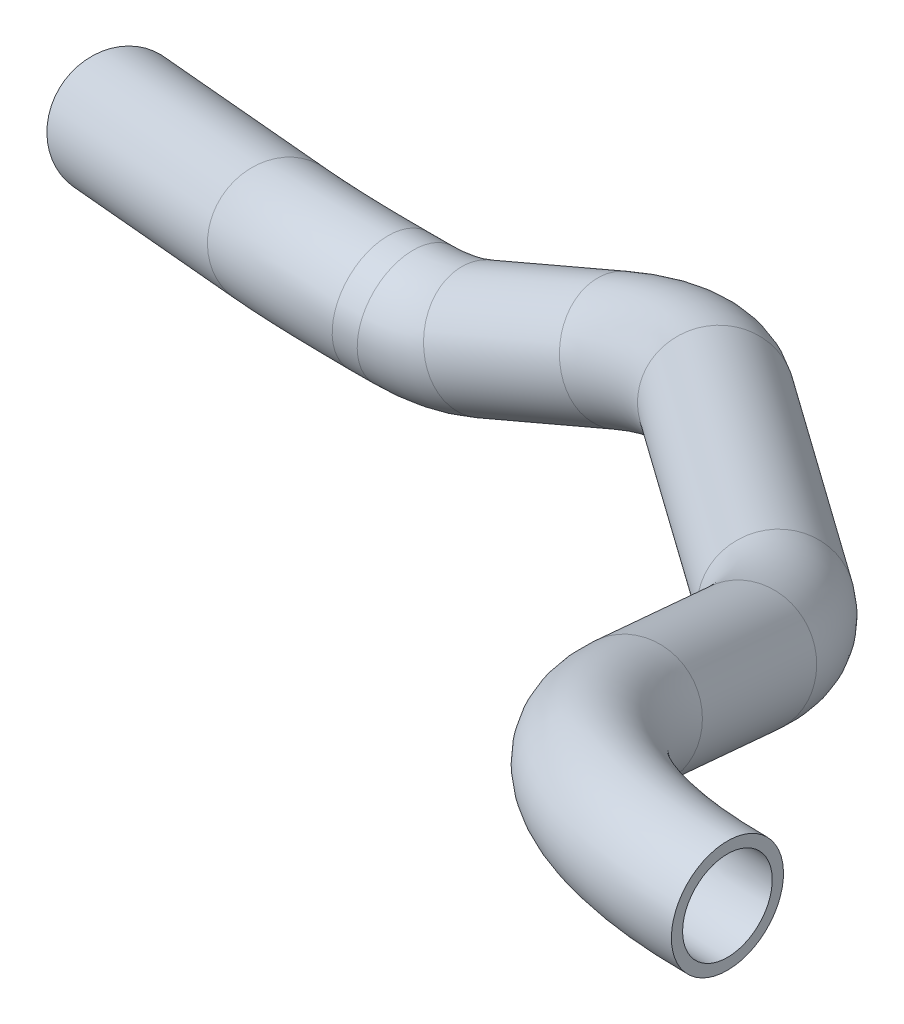
ISO-10303-21;
HEADER;
FILE_DESCRIPTION(('STEP AP214'),'2;1');
FILE_NAME('part.step','',(''),(''),'','','');
FILE_SCHEMA(('AUTOMOTIVE_DESIGN { 1 0 10303 214 1 1 1 1 }'));
ENDSEC;
DATA;
#1=APPLICATION_CONTEXT('core data for automotive mechanical design processes');
#2=APPLICATION_PROTOCOL_DEFINITION('international standard','automotive_design',2000,#1);
#3=PRODUCT_CONTEXT('',#1,'mechanical');
#4=PRODUCT('Part','Part','',(#3));
#5=PRODUCT_RELATED_PRODUCT_CATEGORY('part','',(#4));
#6=PRODUCT_DEFINITION_FORMATION('','',#4);
#7=PRODUCT_DEFINITION_CONTEXT('part definition',#1,'design');
#8=PRODUCT_DEFINITION('design','',#6,#7);
#9=PRODUCT_DEFINITION_SHAPE('','',#8);
#10=(LENGTH_UNIT() NAMED_UNIT(*) SI_UNIT(.MILLI.,.METRE.));
#11=(NAMED_UNIT(*) PLANE_ANGLE_UNIT() SI_UNIT($,.RADIAN.));
#12=(NAMED_UNIT(*) SI_UNIT($,.STERADIAN.) SOLID_ANGLE_UNIT());
#13=UNCERTAINTY_MEASURE_WITH_UNIT(LENGTH_MEASURE(1.E-05),#10,'distance_accuracy_value','');
#14=(GEOMETRIC_REPRESENTATION_CONTEXT(3) GLOBAL_UNCERTAINTY_ASSIGNED_CONTEXT((#13)) GLOBAL_UNIT_ASSIGNED_CONTEXT((#10,
#11,#12)) REPRESENTATION_CONTEXT('',''));
#15=CARTESIAN_POINT('',(0.,0.,0.));
#16=DIRECTION('',(0.,0.,1.));
#17=DIRECTION('',(1.,0.,0.));
#18=AXIS2_PLACEMENT_3D('',#15,#16,#17);
#19=CARTESIAN_POINT('',(1469.87575226089,-192.528815146171,370.16625089659));
#20=DIRECTION('',(-1.,0.,0.));
#21=DIRECTION('',(0.,0.,1.));
#22=AXIS2_PLACEMENT_3D('',#19,#20,#21);
#23=PLANE('',#22);
#24=CARTESIAN_POINT('',(1469.87575226089,-192.528815146171,370.16625089659));
#25=DIRECTION('',(-1.,0.,0.));
#26=DIRECTION('',(0.,0.,1.));
#27=AXIS2_PLACEMENT_3D('',#24,#25,#26);
#28=CIRCLE('',#27,10.);
#29=CARTESIAN_POINT('',(1469.87575226089,-188.752752163523,379.4259133284));
#30=VERTEX_POINT('',#29);
#31=EDGE_CURVE('E88',#30,#30,#28,.T.);
#32=ORIENTED_EDGE('',*,*,#31,.T.);
#33=EDGE_LOOP('',(#32));
#34=FACE_BOUND('',#33,.T.);
#35=CARTESIAN_POINT('',(1469.87575226089,-192.528815146171,370.16625089659));
#36=DIRECTION('',(-1.,0.,0.));
#37=DIRECTION('',(0.,0.,1.));
#38=AXIS2_PLACEMENT_3D('',#35,#36,#37);
#39=CIRCLE('',#38,12.5);
#40=CARTESIAN_POINT('',(1469.87575226089,-187.808736417861,381.740828936352));
#41=VERTEX_POINT('',#40);
#42=EDGE_CURVE('E81',#41,#41,#39,.T.);
#43=ORIENTED_EDGE('',*,*,#42,.F.);
#44=EDGE_LOOP('',(#43));
#45=FACE_BOUND('',#44,.T.);
#46=ADVANCED_FACE('F44',(#34,#45),#23,.F.);
#47=CARTESIAN_POINT('',(1129.69636479831,-313.45862452759,165.695334051761));
#48=DIRECTION('',(-0.909150416365021,-0.26394652904013,-0.32214554200078));
#49=DIRECTION('',(-0.358552645054609,0.102570695912625,0.92785734521226));
#50=AXIS2_PLACEMENT_3D('',#47,#48,#49);
#51=PLANE('',#50);
#52=CARTESIAN_POINT('',(1129.69636479831,-313.45862452759,165.695334051761));
#53=DIRECTION('',(-0.909150416365021,-0.26394652904013,-0.32214554200078));
#54=DIRECTION('',(-0.333989714420841,0.,0.9425767187137));
#55=AXIS2_PLACEMENT_3D('',#52,#53,#54);
#56=CIRCLE('',#55,10.);
#57=CARTESIAN_POINT('',(1126.35646765411,-313.45862452759,175.121101238898));
#58=VERTEX_POINT('',#57);
#59=EDGE_CURVE('E84',#58,#58,#56,.T.);
#60=ORIENTED_EDGE('',*,*,#59,.F.);
#61=EDGE_LOOP('',(#60));
#62=FACE_BOUND('',#61,.T.);
#63=CARTESIAN_POINT('',(1129.69636479831,-313.45862452759,165.695334051761));
#64=DIRECTION('',(-0.909150416365021,-0.26394652904013,-0.32214554200078));
#65=DIRECTION('',(-0.358552645054609,0.102570695912625,0.92785734521226));
#66=AXIS2_PLACEMENT_3D('',#63,#64,#65);
#67=CIRCLE('',#66,12.5);
#68=CARTESIAN_POINT('',(1125.21445673513,-312.176490828682,177.293550866915));
#69=VERTEX_POINT('',#68);
#70=EDGE_CURVE('E11',#69,#69,#67,.T.);
#71=ORIENTED_EDGE('',*,*,#70,.T.);
#72=EDGE_LOOP('',(#71));
#73=FACE_BOUND('',#72,.T.);
#74=ADVANCED_FACE('F146',(#62,#73),#51,.T.);
#75=CARTESIAN_POINT('',(1469.87575226089,-218.961256024707,305.348613873919));
#76=DIRECTION('',(0.,-0.925966243181015,0.37760629826479));
#77=DIRECTION('',(0.,-0.37760629826479,-0.925966243181015));
#78=AXIS2_PLACEMENT_3D('',#75,#76,#77);
#79=TOROIDAL_SURFACE('',#78,70.,12.5);
#80=CARTESIAN_POINT('',(1403.27637901142,-210.822780415799,325.305785455618));
#81=DIRECTION('',(-0.307897240603188,-0.359262039992662,-0.880982449228845));
#82=DIRECTION('',(-0.880982449228845,-0.241994204194298,0.406581762118168));
#83=AXIS2_PLACEMENT_3D('',#80,#81,#82);
#84=CIRCLE('',#83,12.5);
#85=CARTESIAN_POINT('',(1391.38363378831,-209.369481199922,328.869566095207));
#86=VERTEX_POINT('',#85);
#87=EDGE_CURVE('E78',#86,#86,#84,.T.);
#88=CARTESIAN_POINT('',(1469.87575226089,-218.961256024707,305.348613873919));
#89=DIRECTION('',(0.,-0.925966243181015,0.37760629826479));
#90=DIRECTION('',(0.,-0.37760629826479,-0.925966243181015));
#91=AXIS2_PLACEMENT_3D('',#88,#89,#90);
#92=CIRCLE('',#91,82.5);
#93=EDGE_CURVE('',#41,#86,#92,.T.);
#94=ORIENTED_EDGE('',*,*,#42,.T.);
#95=ORIENTED_EDGE('',*,*,#87,.F.);
#96=ORIENTED_EDGE('',*,*,#93,.T.);
#97=ORIENTED_EDGE('',*,*,#93,.F.);
#98=EDGE_LOOP('',(#94,#96,#95,#97));
#99=FACE_BOUND('',#98,.T.);
#100=ADVANCED_FACE('F148',(#99),#79,.T.);
#101=CARTESIAN_POINT('',(1403.27637901142,-210.822780415799,325.305785455618));
#102=DIRECTION('',(-0.30789724060319,-0.35926203999266,-0.880982449228845));
#103=DIRECTION('',(0.,0.925966243181016,-0.377606298264788));
#104=AXIS2_PLACEMENT_3D('',#101,#102,#103);
#105=CYLINDRICAL_SURFACE('',#104,12.5);
#106=CARTESIAN_POINT('',(1389.58101161959,-226.802870454931,286.11940533636));
#107=DIRECTION('',(-0.307897240603189,-0.35926203999266,-0.880982449228845));
#108=DIRECTION('',(-0.880982449228845,-0.241994204194297,0.406581762118169));
#109=AXIS2_PLACEMENT_3D('',#106,#107,#108);
#110=CIRCLE('',#109,12.5);
#111=CARTESIAN_POINT('',(1401.46216860999,-227.743917116426,282.350779625272));
#112=VERTEX_POINT('',#111);
#113=EDGE_CURVE('E75',#112,#112,#110,.T.);
#114=ORIENTED_EDGE('',*,*,#113,.F.);
#115=EDGE_LOOP('',(#114));
#116=FACE_BOUND('',#115,.T.);
#117=ORIENTED_EDGE('',*,*,#87,.T.);
#118=EDGE_LOOP('',(#117));
#119=FACE_BOUND('',#118,.T.);
#120=ADVANCED_FACE('F154',(#116,#119),#105,.T.);
#121=CARTESIAN_POINT('',(1332.55145806565,-222.285846479756,304.208808749585));
#122=DIRECTION('',(-0.0419902854601695,0.930195219391072,-0.364655549455879));
#123=DIRECTION('',(0.,0.36497745262786,0.931016358112616));
#124=AXIS2_PLACEMENT_3D('',#121,#122,#123);
#125=TOROIDAL_SURFACE('',#124,60.,12.5);
#126=CARTESIAN_POINT('',(1372.47298898949,-237.060176470793,261.924171562859));
#127=DIRECTION('',(-0.745341813091706,-0.272219196336702,-0.608573981372001));
#128=DIRECTION('',(-0.612463652726551,-0.0810007611596069,0.786337809583397));
#129=AXIS2_PLACEMENT_3D('',#126,#127,#128);
#130=CIRCLE('',#129,12.5);
#131=CARTESIAN_POINT('',(1380.78997459862,-240.138161885592,253.114872148958));
#132=VERTEX_POINT('',#131);
#133=EDGE_CURVE('E72',#132,#132,#130,.T.);
#134=CARTESIAN_POINT('',(1332.55145806565,-222.285846479756,304.208808749585));
#135=DIRECTION('',(-0.0419902854601695,0.930195219391072,-0.364655549455879));
#136=DIRECTION('',(0.,0.36497745262786,0.931016358112616));
#137=AXIS2_PLACEMENT_3D('',#134,#135,#136);
#138=CIRCLE('',#137,72.5);
#139=EDGE_CURVE('',#112,#132,#138,.T.);
#140=ORIENTED_EDGE('',*,*,#113,.T.);
#141=ORIENTED_EDGE('',*,*,#133,.F.);
#142=ORIENTED_EDGE('',*,*,#139,.T.);
#143=ORIENTED_EDGE('',*,*,#139,.F.);
#144=EDGE_LOOP('',(#140,#142,#141,#143));
#145=FACE_BOUND('',#144,.T.);
#146=ADVANCED_FACE('F176',(#145),#125,.T.);
#147=CARTESIAN_POINT('',(1372.47298898949,-237.060176470793,261.924171562859));
#148=DIRECTION('',(-0.745341813091704,-0.272219196336703,-0.608573981372003));
#149=DIRECTION('',(-0.632458611957457,0.,0.774594154484041));
#150=AXIS2_PLACEMENT_3D('',#147,#148,#149);
#151=CYLINDRICAL_SURFACE('',#150,12.5);
#152=CARTESIAN_POINT('',(1299.93258452587,-263.553914321236,202.694698615891));
#153=DIRECTION('',(-0.745341813091703,-0.272219196336703,-0.608573981372004));
#154=DIRECTION('',(-0.612463652726555,-0.0810007611596083,0.786337809583394));
#155=AXIS2_PLACEMENT_3D('',#152,#153,#154);
#156=CIRCLE('',#155,12.5);
#157=CARTESIAN_POINT('',(1306.67129295279,-259.917043552838,192.814770491105));
#158=VERTEX_POINT('',#157);
#159=EDGE_CURVE('E69',#158,#158,#156,.T.);
#160=ORIENTED_EDGE('',*,*,#159,.F.);
#161=EDGE_LOOP('',(#160));
#162=FACE_BOUND('',#161,.T.);
#163=ORIENTED_EDGE('',*,*,#133,.T.);
#164=EDGE_LOOP('',(#163));
#165=FACE_BOUND('',#164,.T.);
#166=ADVANCED_FACE('F180',(#162,#165),#151,.T.);
#167=CARTESIAN_POINT('',(1267.58678407666,-281.010894009548,250.118353614864));
#168=DIRECTION('',(-0.392224881380258,0.917194092673523,0.0701044848139922));
#169=DIRECTION('',(-0.919456273280743,-0.39319227042846,0.));
#170=AXIS2_PLACEMENT_3D('',#167,#168,#169);
#171=TOROIDAL_SURFACE('',#170,60.,12.5);
#172=CARTESIAN_POINT('',(1265.93291158359,-277.143413508709,190.265974377675));
#173=DIRECTION('',(-0.919456273280742,-0.393192270428462,0.));
#174=DIRECTION('',(-0.0598209863867292,0.139887747913272,0.988358673544919));
#175=AXIS2_PLACEMENT_3D('',#172,#173,#174);
#176=CIRCLE('',#175,12.5);
#177=CARTESIAN_POINT('',(1265.58835481419,-276.337688404367,177.796728703261));
#178=VERTEX_POINT('',#177);
#179=EDGE_CURVE('E66',#178,#178,#176,.T.);
#180=CARTESIAN_POINT('',(1267.58678407666,-281.010894009548,250.118353614864));
#181=DIRECTION('',(-0.392224881380258,0.917194092673523,0.0701044848139922));
#182=DIRECTION('',(-0.919456273280743,-0.39319227042846,0.));
#183=AXIS2_PLACEMENT_3D('',#180,#181,#182);
#184=CIRCLE('',#183,72.5);
#185=EDGE_CURVE('',#158,#178,#184,.T.);
#186=ORIENTED_EDGE('',*,*,#159,.T.);
#187=ORIENTED_EDGE('',*,*,#179,.F.);
#188=ORIENTED_EDGE('',*,*,#185,.T.);
#189=ORIENTED_EDGE('',*,*,#185,.F.);
#190=EDGE_LOOP('',(#186,#188,#187,#189));
#191=FACE_BOUND('',#190,.T.);
#192=ADVANCED_FACE('F184',(#191),#171,.T.);
#193=CARTESIAN_POINT('',(1265.93291158359,-277.143413508708,190.265974377675));
#194=DIRECTION('',(-0.919456273280743,-0.393192270428461,0.));
#195=DIRECTION('',(0.393192270428461,-0.919456273280743,0.));
#196=AXIS2_PLACEMENT_3D('',#193,#194,#195);
#197=CYLINDRICAL_SURFACE('',#196,12.5);
#198=CARTESIAN_POINT('',(1235.6226017192,-290.10518221843,190.265974377676));
#199=DIRECTION('',(-0.919456273280742,-0.393192270428462,0.));
#200=DIRECTION('',(-0.0598209863867275,0.139887747913272,0.988358673544919));
#201=AXIS2_PLACEMENT_3D('',#198,#199,#200);
#202=CIRCLE('',#201,12.5);
#203=CARTESIAN_POINT('',(1240.53750509956,-301.59838563444,190.265974377678));
#204=VERTEX_POINT('',#203);
#205=EDGE_CURVE('E63',#204,#204,#202,.T.);
#206=ORIENTED_EDGE('',*,*,#205,.F.);
#207=EDGE_LOOP('',(#206));
#208=FACE_BOUND('',#207,.T.);
#209=ORIENTED_EDGE('',*,*,#179,.T.);
#210=EDGE_LOOP('',(#209));
#211=FACE_BOUND('',#210,.T.);
#212=ADVANCED_FACE('F188',(#208,#211),#197,.T.);
#213=CARTESIAN_POINT('',(1219.89491090206,-253.326931287201,190.26597437767));
#214=DIRECTION('',(0.,0.,-1.));
#215=DIRECTION('',(0.,1.,0.));
#216=AXIS2_PLACEMENT_3D('',#213,#214,#215);
#217=TOROIDAL_SURFACE('',#216,40.,12.5);
#218=CARTESIAN_POINT('',(1219.89491090206,-293.326931287201,190.265974377673));
#219=DIRECTION('',(-1.,0.,0.));
#220=DIRECTION('',(0.,0.152141816830646,0.988358673544918));
#221=AXIS2_PLACEMENT_3D('',#218,#219,#220);
#222=CIRCLE('',#221,12.5);
#223=CARTESIAN_POINT('',(1219.89491090206,-305.826931287201,190.265974377674));
#224=VERTEX_POINT('',#223);
#225=EDGE_CURVE('E58',#224,#224,#222,.T.);
#226=CARTESIAN_POINT('',(1219.89491090206,-253.326931287201,190.26597437767));
#227=DIRECTION('',(0.,0.,-1.));
#228=DIRECTION('',(0.,1.,0.));
#229=AXIS2_PLACEMENT_3D('',#226,#227,#228);
#230=CIRCLE('',#229,52.5);
#231=EDGE_CURVE('',#204,#224,#230,.T.);
#232=ORIENTED_EDGE('',*,*,#205,.T.);
#233=ORIENTED_EDGE('',*,*,#225,.F.);
#234=ORIENTED_EDGE('',*,*,#231,.T.);
#235=ORIENTED_EDGE('',*,*,#231,.F.);
#236=EDGE_LOOP('',(#232,#234,#233,#235));
#237=FACE_BOUND('',#236,.T.);
#238=ADVANCED_FACE('F192',(#237),#217,.T.);
#239=CARTESIAN_POINT('',(1219.89491090206,-293.326931287201,190.265974377676));
#240=DIRECTION('',(-1.,0.,0.));
#241=DIRECTION('',(0.,0.,1.));
#242=AXIS2_PLACEMENT_3D('',#239,#240,#241);
#243=CYLINDRICAL_SURFACE('',#242,12.5);
#244=CARTESIAN_POINT('',(1214.30897397537,-293.326931287201,190.265974377676));
#245=DIRECTION('',(-1.,0.,0.));
#246=DIRECTION('',(0.,0.152141816830646,0.988358673544918));
#247=AXIS2_PLACEMENT_3D('',#244,#245,#246);
#248=CIRCLE('',#247,12.5);
#249=CARTESIAN_POINT('',(1214.30897397537,-285.404756420129,199.934952885023));
#250=VERTEX_POINT('',#249);
#251=EDGE_CURVE('E54',#250,#250,#248,.T.);
#252=ORIENTED_EDGE('',*,*,#251,.F.);
#253=EDGE_LOOP('',(#252));
#254=FACE_BOUND('',#253,.T.);
#255=ORIENTED_EDGE('',*,*,#225,.T.);
#256=EDGE_LOOP('',(#255));
#257=FACE_BOUND('',#256,.T.);
#258=ADVANCED_FACE('F141',(#254,#257),#243,.T.);
#259=CARTESIAN_POINT('',(1214.30897397537,-337.691110542803,136.119694736534));
#260=DIRECTION('',(0.,-0.773518280587749,0.633773989365745));
#261=DIRECTION('',(0.,-0.633773989365745,-0.773518280587749));
#262=AXIS2_PLACEMENT_3D('',#259,#260,#261);
#263=TOROIDAL_SURFACE('',#262,70.,12.5);
#264=CARTESIAN_POINT('',(1185.15622024481,-297.35739850088,185.346807416895));
#265=DIRECTION('',(-0.909150416365022,-0.263946529040128,-0.32214554200078));
#266=DIRECTION('',(-0.358552645054608,0.102570695912625,0.927857345212261));
#267=AXIS2_PLACEMENT_3D('',#264,#265,#266);
#268=CIRCLE('',#267,12.5);
#269=CARTESIAN_POINT('',(1179.95037136436,-290.154949921965,194.137363252674));
#270=VERTEX_POINT('',#269);
#271=EDGE_CURVE('E50',#270,#270,#268,.T.);
#272=CARTESIAN_POINT('',(1214.30897397537,-337.691110542803,136.119694736534));
#273=DIRECTION('',(0.,-0.773518280587749,0.633773989365745));
#274=DIRECTION('',(0.,-0.633773989365745,-0.773518280587749));
#275=AXIS2_PLACEMENT_3D('',#272,#273,#274);
#276=CIRCLE('',#275,82.5);
#277=EDGE_CURVE('',#250,#270,#276,.T.);
#278=ORIENTED_EDGE('',*,*,#251,.T.);
#279=ORIENTED_EDGE('',*,*,#271,.F.);
#280=ORIENTED_EDGE('',*,*,#277,.T.);
#281=ORIENTED_EDGE('',*,*,#277,.F.);
#282=EDGE_LOOP('',(#278,#280,#279,#281));
#283=FACE_BOUND('',#282,.T.);
#284=ADVANCED_FACE('F136',(#283),#263,.T.);
#285=CARTESIAN_POINT('',(1185.15622024481,-297.35739850088,185.346807416895));
#286=DIRECTION('',(-0.909150416365022,-0.263946529040128,-0.32214554200078));
#287=DIRECTION('',(-0.33398971442084,0.,0.9425767187137));
#288=AXIS2_PLACEMENT_3D('',#285,#286,#287);
#289=CYLINDRICAL_SURFACE('',#288,12.5);
#290=ORIENTED_EDGE('',*,*,#271,.T.);
#291=EDGE_LOOP('',(#290));
#292=FACE_BOUND('',#291,.T.);
#293=ORIENTED_EDGE('',*,*,#70,.F.);
#294=EDGE_LOOP('',(#293));
#295=FACE_BOUND('',#294,.T.);
#296=ADVANCED_FACE('F133',(#292,#295),#289,.T.);
#297=CARTESIAN_POINT('',(1469.87575226089,-218.961256024707,305.348613873919));
#298=DIRECTION('',(0.,-0.925966243181015,0.37760629826479));
#299=DIRECTION('',(0.,-0.37760629826479,-0.925966243181015));
#300=AXIS2_PLACEMENT_3D('',#297,#298,#299);
#301=TOROIDAL_SURFACE('',#300,70.,10.);
#302=CARTESIAN_POINT('',(1403.27637901142,-210.822780415799,325.305785455618));
#303=DIRECTION('',(-0.30789724060319,-0.35926203999266,-0.880982449228845));
#304=DIRECTION('',(0.,0.925966243181016,-0.377606298264788));
#305=AXIS2_PLACEMENT_3D('',#302,#303,#304);
#306=CIRCLE('',#305,10.);
#307=CARTESIAN_POINT('',(1393.76218283293,-209.660141043098,328.156809967289));
#308=VERTEX_POINT('',#307);
#309=EDGE_CURVE('E91',#308,#308,#306,.T.);
#310=CARTESIAN_POINT('',(1469.87575226089,-218.961256024707,305.348613873919));
#311=DIRECTION('',(0.,-0.925966243181015,0.37760629826479));
#312=DIRECTION('',(0.,-0.37760629826479,-0.925966243181015));
#313=AXIS2_PLACEMENT_3D('',#310,#311,#312);
#314=CIRCLE('',#313,80.);
#315=EDGE_CURVE('',#30,#308,#314,.T.);
#316=ORIENTED_EDGE('',*,*,#31,.F.);
#317=ORIENTED_EDGE('',*,*,#309,.T.);
#318=ORIENTED_EDGE('',*,*,#315,.T.);
#319=ORIENTED_EDGE('',*,*,#315,.F.);
#320=EDGE_LOOP('',(#316,#318,#317,#319));
#321=FACE_BOUND('',#320,.T.);
#322=ADVANCED_FACE('F118',(#321),#301,.F.);
#323=CARTESIAN_POINT('',(1403.27637901142,-210.822780415799,325.305785455618));
#324=DIRECTION('',(-0.30789724060319,-0.35926203999266,-0.880982449228845));
#325=DIRECTION('',(0.,0.925966243181016,-0.377606298264788));
#326=AXIS2_PLACEMENT_3D('',#323,#324,#325);
#327=CYLINDRICAL_SURFACE('',#326,10.);
#328=CARTESIAN_POINT('',(1389.58101161959,-226.802870454931,286.11940533636));
#329=DIRECTION('',(0.307897240603193,0.35926203999266,0.880982449228843));
#330=DIRECTION('',(0.,-0.925966243181015,0.377606298264789));
#331=AXIS2_PLACEMENT_3D('',#328,#329,#330);
#332=CIRCLE('',#331,10.);
#333=CARTESIAN_POINT('',(1399.08593721191,-227.555707784127,283.104504767489));
#334=VERTEX_POINT('',#333);
#335=EDGE_CURVE('E112',#334,#334,#332,.F.);
#336=ORIENTED_EDGE('',*,*,#335,.T.);
#337=EDGE_LOOP('',(#336));
#338=FACE_BOUND('',#337,.T.);
#339=ORIENTED_EDGE('',*,*,#309,.F.);
#340=EDGE_LOOP('',(#339));
#341=FACE_BOUND('',#340,.T.);
#342=ADVANCED_FACE('F121',(#338,#341),#327,.F.);
#343=CARTESIAN_POINT('',(1332.55145806565,-222.285846479756,304.208808749585));
#344=DIRECTION('',(-0.0419902854601695,0.930195219391072,-0.364655549455879));
#345=DIRECTION('',(0.,0.36497745262786,0.931016358112616));
#346=AXIS2_PLACEMENT_3D('',#343,#344,#345);
#347=TOROIDAL_SURFACE('',#346,60.,10.);
#348=CARTESIAN_POINT('',(1372.47298898949,-237.060176470793,261.924171562859));
#349=DIRECTION('',(-0.745341813091704,-0.272219196336703,-0.608573981372003));
#350=DIRECTION('',(-0.632458611957457,0.,0.774594154484041));
#351=AXIS2_PLACEMENT_3D('',#348,#349,#350);
#352=CIRCLE('',#351,10.);
#353=CARTESIAN_POINT('',(1379.1265774768,-239.522564802633,254.876732031739));
#354=VERTEX_POINT('',#353);
#355=EDGE_CURVE('E109',#354,#354,#352,.T.);
#356=CARTESIAN_POINT('',(1332.55145806565,-222.285846479756,304.208808749585));
#357=DIRECTION('',(-0.0419902854601695,0.930195219391072,-0.364655549455879));
#358=DIRECTION('',(0.,0.36497745262786,0.931016358112616));
#359=AXIS2_PLACEMENT_3D('',#356,#357,#358);
#360=CIRCLE('',#359,70.);
#361=EDGE_CURVE('',#334,#354,#360,.T.);
#362=ORIENTED_EDGE('',*,*,#335,.F.);
#363=ORIENTED_EDGE('',*,*,#355,.T.);
#364=ORIENTED_EDGE('',*,*,#361,.T.);
#365=ORIENTED_EDGE('',*,*,#361,.F.);
#366=EDGE_LOOP('',(#362,#364,#363,#365));
#367=FACE_BOUND('',#366,.T.);
#368=ADVANCED_FACE('F123',(#367),#347,.F.);
#369=CARTESIAN_POINT('',(1372.47298898949,-237.060176470793,261.924171562859));
#370=DIRECTION('',(-0.745341813091704,-0.272219196336703,-0.608573981372003));
#371=DIRECTION('',(-0.632458611957457,0.,0.774594154484041));
#372=AXIS2_PLACEMENT_3D('',#369,#370,#371);
#373=CYLINDRICAL_SURFACE('',#372,10.);
#374=CARTESIAN_POINT('',(1299.93258452587,-263.553914321236,202.694698615891));
#375=DIRECTION('',(0.745341813091706,0.272219196336701,0.608573981372001));
#376=DIRECTION('',(0.632458611957455,0.,-0.774594154484043));
#377=AXIS2_PLACEMENT_3D('',#374,#375,#376);
#378=CIRCLE('',#377,10.);
#379=CARTESIAN_POINT('',(1305.32355126741,-260.644417706518,194.790756116063));
#380=VERTEX_POINT('',#379);
#381=EDGE_CURVE('E106',#380,#380,#378,.F.);
#382=ORIENTED_EDGE('',*,*,#381,.T.);
#383=EDGE_LOOP('',(#382));
#384=FACE_BOUND('',#383,.T.);
#385=ORIENTED_EDGE('',*,*,#355,.F.);
#386=EDGE_LOOP('',(#385));
#387=FACE_BOUND('',#386,.T.);
#388=ADVANCED_FACE('F130',(#384,#387),#373,.F.);
#389=CARTESIAN_POINT('',(1267.58678407666,-281.010894009548,250.118353614864));
#390=DIRECTION('',(-0.392224881380258,0.917194092673523,0.0701044848139922));
#391=DIRECTION('',(-0.919456273280743,-0.39319227042846,0.));
#392=AXIS2_PLACEMENT_3D('',#389,#390,#391);
#393=TOROIDAL_SURFACE('',#392,60.,10.);
#394=CARTESIAN_POINT('',(1265.93291158358,-277.143413508708,190.265974377675));
#395=DIRECTION('',(-0.919456273280743,-0.393192270428461,0.));
#396=DIRECTION('',(0.393192270428461,-0.919456273280743,0.));
#397=AXIS2_PLACEMENT_3D('',#394,#395,#396);
#398=CIRCLE('',#397,10.);
#399=CARTESIAN_POINT('',(1265.65726616807,-276.498833425235,180.290577838144));
#400=VERTEX_POINT('',#399);
#401=EDGE_CURVE('E103',#400,#400,#398,.T.);
#402=CARTESIAN_POINT('',(1267.58678407666,-281.010894009548,250.118353614864));
#403=DIRECTION('',(-0.392224881380258,0.917194092673523,0.0701044848139922));
#404=DIRECTION('',(-0.919456273280743,-0.39319227042846,0.));
#405=AXIS2_PLACEMENT_3D('',#402,#403,#404);
#406=CIRCLE('',#405,70.);
#407=EDGE_CURVE('',#380,#400,#406,.T.);
#408=ORIENTED_EDGE('',*,*,#381,.F.);
#409=ORIENTED_EDGE('',*,*,#401,.T.);
#410=ORIENTED_EDGE('',*,*,#407,.T.);
#411=ORIENTED_EDGE('',*,*,#407,.F.);
#412=EDGE_LOOP('',(#408,#410,#409,#411));
#413=FACE_BOUND('',#412,.T.);
#414=ADVANCED_FACE('F255',(#413),#393,.F.);
#415=CARTESIAN_POINT('',(1265.93291158359,-277.143413508708,190.265974377675));
#416=DIRECTION('',(-0.919456273280743,-0.393192270428461,0.));
#417=DIRECTION('',(0.393192270428461,-0.919456273280743,0.));
#418=AXIS2_PLACEMENT_3D('',#415,#416,#417);
#419=CYLINDRICAL_SURFACE('',#418,10.);
#420=CARTESIAN_POINT('',(1235.6226017192,-290.10518221843,190.265974377673));
#421=DIRECTION('',(0.919456273280743,0.393192270428461,0.));
#422=DIRECTION('',(-0.393192270428461,0.919456273280743,0.));
#423=AXIS2_PLACEMENT_3D('',#420,#421,#422);
#424=CIRCLE('',#423,10.);
#425=CARTESIAN_POINT('',(1239.55452442348,-299.299744951238,190.265974377673));
#426=VERTEX_POINT('',#425);
#427=EDGE_CURVE('E100',#426,#426,#424,.F.);
#428=ORIENTED_EDGE('',*,*,#427,.T.);
#429=EDGE_LOOP('',(#428));
#430=FACE_BOUND('',#429,.T.);
#431=ORIENTED_EDGE('',*,*,#401,.F.);
#432=EDGE_LOOP('',(#431));
#433=FACE_BOUND('',#432,.T.);
#434=ADVANCED_FACE('F265',(#430,#433),#419,.F.);
#435=CARTESIAN_POINT('',(1219.89491090206,-253.326931287201,190.26597437767));
#436=DIRECTION('',(0.,0.,-1.));
#437=DIRECTION('',(0.,1.,0.));
#438=AXIS2_PLACEMENT_3D('',#435,#436,#437);
#439=TOROIDAL_SURFACE('',#438,40.,10.);
#440=CARTESIAN_POINT('',(1219.89491090206,-293.326931287201,190.265974377676));
#441=DIRECTION('',(-1.,0.,0.));
#442=DIRECTION('',(0.,0.,1.));
#443=AXIS2_PLACEMENT_3D('',#440,#441,#442);
#444=CIRCLE('',#443,10.);
#445=CARTESIAN_POINT('',(1219.89491090206,-303.326931287201,190.265974377678));
#446=VERTEX_POINT('',#445);
#447=EDGE_CURVE('E97',#446,#446,#444,.T.);
#448=CARTESIAN_POINT('',(1219.89491090206,-253.326931287201,190.26597437767));
#449=DIRECTION('',(0.,0.,-1.));
#450=DIRECTION('',(0.,1.,0.));
#451=AXIS2_PLACEMENT_3D('',#448,#449,#450);
#452=CIRCLE('',#451,50.);
#453=EDGE_CURVE('',#426,#446,#452,.T.);
#454=ORIENTED_EDGE('',*,*,#427,.F.);
#455=ORIENTED_EDGE('',*,*,#447,.T.);
#456=ORIENTED_EDGE('',*,*,#453,.T.);
#457=ORIENTED_EDGE('',*,*,#453,.F.);
#458=EDGE_LOOP('',(#454,#456,#455,#457));
#459=FACE_BOUND('',#458,.T.);
#460=ADVANCED_FACE('F275',(#459),#439,.F.);
#461=CARTESIAN_POINT('',(1219.89491090206,-293.326931287201,190.265974377676));
#462=DIRECTION('',(-1.,0.,0.));
#463=DIRECTION('',(0.,0.,1.));
#464=AXIS2_PLACEMENT_3D('',#461,#462,#463);
#465=CYLINDRICAL_SURFACE('',#464,10.);
#466=CARTESIAN_POINT('',(1214.30897397537,-293.326931287201,190.265974377676));
#467=DIRECTION('',(1.,0.,0.));
#468=DIRECTION('',(0.,0.,-1.));
#469=AXIS2_PLACEMENT_3D('',#466,#467,#468);
#470=CIRCLE('',#469,10.);
#471=CARTESIAN_POINT('',(1214.30897397537,-286.989191393543,198.001157183554));
#472=VERTEX_POINT('',#471);
#473=EDGE_CURVE('E94',#472,#472,#470,.F.);
#474=ORIENTED_EDGE('',*,*,#473,.T.);
#475=EDGE_LOOP('',(#474));
#476=FACE_BOUND('',#475,.T.);
#477=ORIENTED_EDGE('',*,*,#447,.F.);
#478=EDGE_LOOP('',(#477));
#479=FACE_BOUND('',#478,.T.);
#480=ADVANCED_FACE('F168',(#476,#479),#465,.F.);
#481=CARTESIAN_POINT('',(1214.30897397537,-337.691110542803,136.119694736534));
#482=DIRECTION('',(0.,-0.773518280587749,0.633773989365745));
#483=DIRECTION('',(0.,-0.633773989365745,-0.773518280587749));
#484=AXIS2_PLACEMENT_3D('',#481,#482,#483);
#485=TOROIDAL_SURFACE('',#484,70.,10.);
#486=CARTESIAN_POINT('',(1185.15622024481,-297.35739850088,185.346807416895));
#487=DIRECTION('',(-0.909150416365022,-0.263946529040128,-0.32214554200078));
#488=DIRECTION('',(-0.33398971442084,0.,0.9425767187137));
#489=AXIS2_PLACEMENT_3D('',#486,#487,#488);
#490=CIRCLE('',#489,10.);
#491=CARTESIAN_POINT('',(1180.99154114045,-291.595439637748,192.379252085518));
#492=VERTEX_POINT('',#491);
#493=EDGE_CURVE('E87',#492,#492,#490,.T.);
#494=CARTESIAN_POINT('',(1214.30897397537,-337.691110542803,136.119694736534));
#495=DIRECTION('',(0.,-0.773518280587749,0.633773989365745));
#496=DIRECTION('',(0.,-0.633773989365745,-0.773518280587749));
#497=AXIS2_PLACEMENT_3D('',#494,#495,#496);
#498=CIRCLE('',#497,80.);
#499=EDGE_CURVE('',#472,#492,#498,.T.);
#500=ORIENTED_EDGE('',*,*,#473,.F.);
#501=ORIENTED_EDGE('',*,*,#493,.T.);
#502=ORIENTED_EDGE('',*,*,#499,.T.);
#503=ORIENTED_EDGE('',*,*,#499,.F.);
#504=EDGE_LOOP('',(#500,#502,#501,#503));
#505=FACE_BOUND('',#504,.T.);
#506=ADVANCED_FACE('F162',(#505),#485,.F.);
#507=CARTESIAN_POINT('',(1185.15622024481,-297.35739850088,185.346807416895));
#508=DIRECTION('',(-0.909150416365022,-0.263946529040128,-0.32214554200078));
#509=DIRECTION('',(-0.33398971442084,0.,0.9425767187137));
#510=AXIS2_PLACEMENT_3D('',#507,#508,#509);
#511=CYLINDRICAL_SURFACE('',#510,10.);
#512=ORIENTED_EDGE('',*,*,#493,.F.);
#513=EDGE_LOOP('',(#512));
#514=FACE_BOUND('',#513,.T.);
#515=ORIENTED_EDGE('',*,*,#59,.T.);
#516=EDGE_LOOP('',(#515));
#517=FACE_BOUND('',#516,.T.);
#518=ADVANCED_FACE('F158',(#514,#517),#511,.F.);
#519=CLOSED_SHELL('',(#46,#74,#100,#120,#146,#166,#192,#212,#238,#258,#284,#296,#322,#342,#368,
#388,#414,#434,#460,#480,#506,#518));
#520=MANIFOLD_SOLID_BREP('B2',#519);
#521=ADVANCED_BREP_SHAPE_REPRESENTATION('',(#18,#520),#14);
#522=SHAPE_DEFINITION_REPRESENTATION(#9,#521);
ENDSEC;
END-ISO-10303-21;
